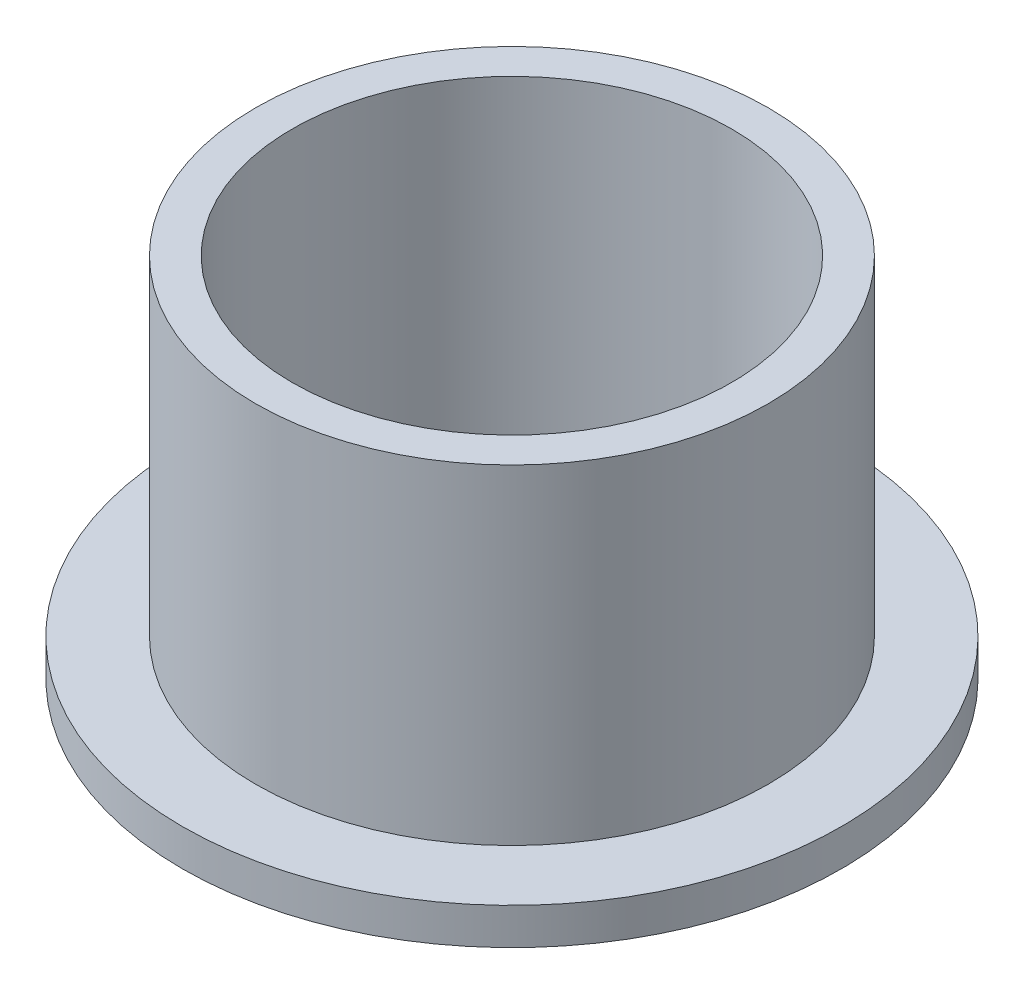
ISO-10303-21;
HEADER;
FILE_DESCRIPTION(('STEP AP214'),'2;1');
FILE_NAME('part.step','',(''),(''),'','','');
FILE_SCHEMA(('AUTOMOTIVE_DESIGN { 1 0 10303 214 1 1 1 1 }'));
ENDSEC;
DATA;
#1=APPLICATION_CONTEXT('core data for automotive mechanical design processes');
#2=APPLICATION_PROTOCOL_DEFINITION('international standard','automotive_design',2000,#1);
#3=PRODUCT_CONTEXT('',#1,'mechanical');
#4=PRODUCT('Part','Part','',(#3));
#5=PRODUCT_RELATED_PRODUCT_CATEGORY('part','',(#4));
#6=PRODUCT_DEFINITION_FORMATION('','',#4);
#7=PRODUCT_DEFINITION_CONTEXT('part definition',#1,'design');
#8=PRODUCT_DEFINITION('design','',#6,#7);
#9=PRODUCT_DEFINITION_SHAPE('','',#8);
#10=(LENGTH_UNIT() NAMED_UNIT(*) SI_UNIT(.MILLI.,.METRE.));
#11=(NAMED_UNIT(*) PLANE_ANGLE_UNIT() SI_UNIT($,.RADIAN.));
#12=(NAMED_UNIT(*) SI_UNIT($,.STERADIAN.) SOLID_ANGLE_UNIT());
#13=UNCERTAINTY_MEASURE_WITH_UNIT(LENGTH_MEASURE(1.E-05),#10,'distance_accuracy_value','');
#14=(GEOMETRIC_REPRESENTATION_CONTEXT(3) GLOBAL_UNCERTAINTY_ASSIGNED_CONTEXT((#13)) GLOBAL_UNIT_ASSIGNED_CONTEXT((#10,
#11,#12)) REPRESENTATION_CONTEXT('',''));
#15=CARTESIAN_POINT('',(0.,0.,0.));
#16=DIRECTION('',(0.,0.,1.));
#17=DIRECTION('',(1.,0.,0.));
#18=AXIS2_PLACEMENT_3D('',#15,#16,#17);
#19=CARTESIAN_POINT('',(0.,10.,0.));
#20=DIRECTION('',(0.,1.,0.));
#21=DIRECTION('',(0.,0.,1.));
#22=AXIS2_PLACEMENT_3D('',#19,#20,#21);
#23=PLANE('',#22);
#24=CARTESIAN_POINT('',(0.,10.,0.));
#25=DIRECTION('',(0.,1.,0.));
#26=DIRECTION('',(0.,0.,1.));
#27=AXIS2_PLACEMENT_3D('',#24,#25,#26);
#28=CIRCLE('',#27,7.);
#29=CARTESIAN_POINT('',(0.,10.,7.));
#30=VERTEX_POINT('',#29);
#31=EDGE_CURVE('E10',#30,#30,#28,.T.);
#32=ORIENTED_EDGE('',*,*,#31,.T.);
#33=EDGE_LOOP('',(#32));
#34=FACE_BOUND('',#33,.T.);
#35=CARTESIAN_POINT('',(0.,10.,0.));
#36=DIRECTION('',(0.,1.,0.));
#37=DIRECTION('',(0.,0.,1.));
#38=AXIS2_PLACEMENT_3D('',#35,#36,#37);
#39=CIRCLE('',#38,6.);
#40=CARTESIAN_POINT('',(0.,10.,6.));
#41=VERTEX_POINT('',#40);
#42=EDGE_CURVE('E40',#41,#41,#39,.T.);
#43=ORIENTED_EDGE('',*,*,#42,.F.);
#44=EDGE_LOOP('',(#43));
#45=FACE_BOUND('',#44,.T.);
#46=ADVANCED_FACE('F33',(#34,#45),#23,.T.);
#47=CARTESIAN_POINT('',(0.,0.,0.));
#48=DIRECTION('',(0.,1.,0.));
#49=DIRECTION('',(0.,0.,1.));
#50=AXIS2_PLACEMENT_3D('',#47,#48,#49);
#51=PLANE('',#50);
#52=CARTESIAN_POINT('',(0.,0.,0.));
#53=DIRECTION('',(0.,1.,0.));
#54=DIRECTION('',(0.,0.,1.));
#55=AXIS2_PLACEMENT_3D('',#52,#53,#54);
#56=CIRCLE('',#55,6.);
#57=CARTESIAN_POINT('',(0.,0.,6.));
#58=VERTEX_POINT('',#57);
#59=EDGE_CURVE('E44',#58,#58,#56,.T.);
#60=ORIENTED_EDGE('',*,*,#59,.T.);
#61=EDGE_LOOP('',(#60));
#62=FACE_BOUND('',#61,.T.);
#63=CARTESIAN_POINT('',(0.,0.,0.));
#64=DIRECTION('',(0.,1.,0.));
#65=DIRECTION('',(0.,0.,1.));
#66=AXIS2_PLACEMENT_3D('',#63,#64,#65);
#67=CIRCLE('',#66,9.);
#68=CARTESIAN_POINT('',(0.,0.,9.));
#69=VERTEX_POINT('',#68);
#70=EDGE_CURVE('E51',#69,#69,#67,.T.);
#71=ORIENTED_EDGE('',*,*,#70,.F.);
#72=EDGE_LOOP('',(#71));
#73=FACE_BOUND('',#72,.T.);
#74=ADVANCED_FACE('F76',(#62,#73),#51,.F.);
#75=CARTESIAN_POINT('',(0.,10.,0.));
#76=DIRECTION('',(0.,-1.,0.));
#77=DIRECTION('',(0.,0.,-1.));
#78=AXIS2_PLACEMENT_3D('',#75,#76,#77);
#79=CYLINDRICAL_SURFACE('',#78,7.);
#80=CARTESIAN_POINT('',(0.,1.,0.));
#81=DIRECTION('',(0.,1.,0.));
#82=DIRECTION('',(0.,0.,1.));
#83=AXIS2_PLACEMENT_3D('',#80,#81,#82);
#84=CIRCLE('',#83,7.);
#85=CARTESIAN_POINT('',(0.,1.,7.));
#86=VERTEX_POINT('',#85);
#87=EDGE_CURVE('E54',#86,#86,#84,.T.);
#88=ORIENTED_EDGE('',*,*,#87,.T.);
#89=EDGE_LOOP('',(#88));
#90=FACE_BOUND('',#89,.T.);
#91=ORIENTED_EDGE('',*,*,#31,.F.);
#92=EDGE_LOOP('',(#91));
#93=FACE_BOUND('',#92,.T.);
#94=ADVANCED_FACE('F35',(#90,#93),#79,.T.);
#95=CARTESIAN_POINT('',(0.,10.,0.));
#96=DIRECTION('',(0.,-1.,0.));
#97=DIRECTION('',(0.,0.,-1.));
#98=AXIS2_PLACEMENT_3D('',#95,#96,#97);
#99=CYLINDRICAL_SURFACE('',#98,6.);
#100=ORIENTED_EDGE('',*,*,#42,.T.);
#101=EDGE_LOOP('',(#100));
#102=FACE_BOUND('',#101,.T.);
#103=ORIENTED_EDGE('',*,*,#59,.F.);
#104=EDGE_LOOP('',(#103));
#105=FACE_BOUND('',#104,.T.);
#106=ADVANCED_FACE('F65',(#102,#105),#99,.F.);
#107=CARTESIAN_POINT('',(0.,1.,0.));
#108=DIRECTION('',(0.,1.,0.));
#109=DIRECTION('',(0.,0.,1.));
#110=AXIS2_PLACEMENT_3D('',#107,#108,#109);
#111=PLANE('',#110);
#112=CARTESIAN_POINT('',(0.,1.,0.));
#113=DIRECTION('',(0.,1.,0.));
#114=DIRECTION('',(0.,0.,1.));
#115=AXIS2_PLACEMENT_3D('',#112,#113,#114);
#116=CIRCLE('',#115,9.);
#117=CARTESIAN_POINT('',(0.,1.,9.));
#118=VERTEX_POINT('',#117);
#119=EDGE_CURVE('E49',#118,#118,#116,.T.);
#120=ORIENTED_EDGE('',*,*,#119,.T.);
#121=EDGE_LOOP('',(#120));
#122=FACE_BOUND('',#121,.T.);
#123=ORIENTED_EDGE('',*,*,#87,.F.);
#124=EDGE_LOOP('',(#123));
#125=FACE_BOUND('',#124,.T.);
#126=ADVANCED_FACE('F62',(#122,#125),#111,.T.);
#127=CARTESIAN_POINT('',(0.,1.,0.));
#128=DIRECTION('',(0.,-1.,0.));
#129=DIRECTION('',(0.,0.,-1.));
#130=AXIS2_PLACEMENT_3D('',#127,#128,#129);
#131=CYLINDRICAL_SURFACE('',#130,9.);
#132=ORIENTED_EDGE('',*,*,#119,.F.);
#133=EDGE_LOOP('',(#132));
#134=FACE_BOUND('',#133,.T.);
#135=ORIENTED_EDGE('',*,*,#70,.T.);
#136=EDGE_LOOP('',(#135));
#137=FACE_BOUND('',#136,.T.);
#138=ADVANCED_FACE('F64',(#134,#137),#131,.T.);
#139=CLOSED_SHELL('',(#46,#74,#94,#106,#126,#138));
#140=MANIFOLD_SOLID_BREP('B2',#139);
#141=ADVANCED_BREP_SHAPE_REPRESENTATION('',(#18,#140),#14);
#142=SHAPE_DEFINITION_REPRESENTATION(#9,#141);
ENDSEC;
END-ISO-10303-21;
